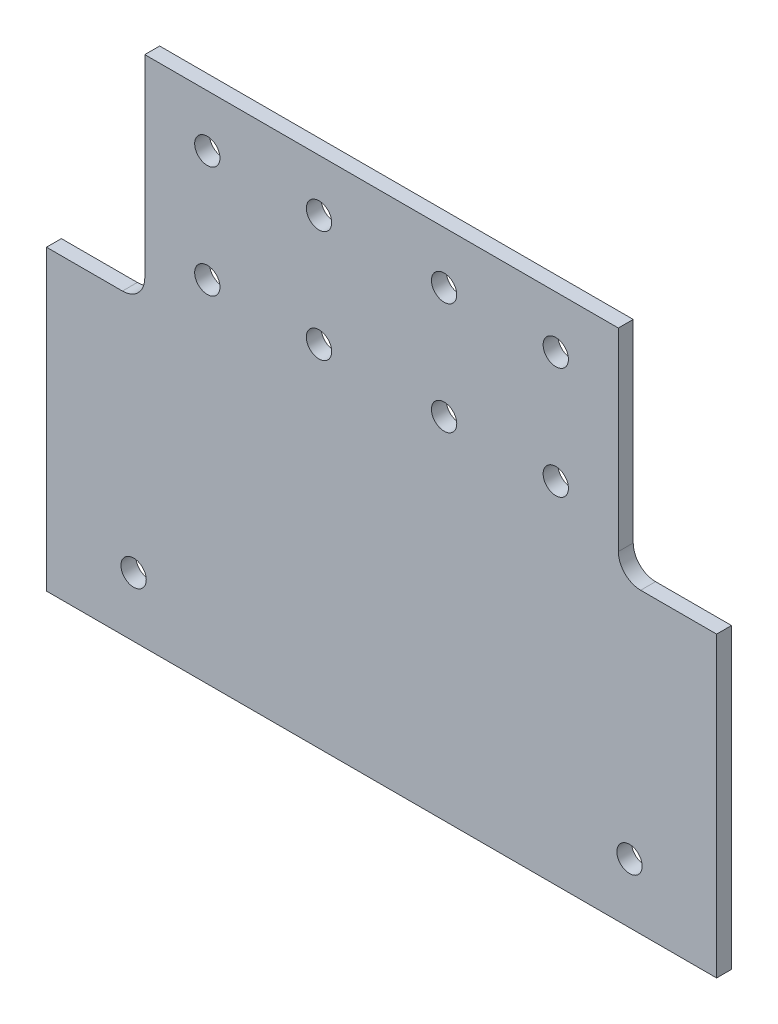
ISO-10303-21;
HEADER;
FILE_DESCRIPTION(('STEP AP214'),'2;1');
FILE_NAME('part.step','',(''),(''),'','','');
FILE_SCHEMA(('AUTOMOTIVE_DESIGN { 1 0 10303 214 1 1 1 1 }'));
ENDSEC;
DATA;
#1=APPLICATION_CONTEXT('core data for automotive mechanical design processes');
#2=APPLICATION_PROTOCOL_DEFINITION('international standard','automotive_design',2000,#1);
#3=PRODUCT_CONTEXT('',#1,'mechanical');
#4=PRODUCT('Part','Part','',(#3));
#5=PRODUCT_RELATED_PRODUCT_CATEGORY('part','',(#4));
#6=PRODUCT_DEFINITION_FORMATION('','',#4);
#7=PRODUCT_DEFINITION_CONTEXT('part definition',#1,'design');
#8=PRODUCT_DEFINITION('design','',#6,#7);
#9=PRODUCT_DEFINITION_SHAPE('','',#8);
#10=(LENGTH_UNIT() NAMED_UNIT(*) SI_UNIT(.MILLI.,.METRE.));
#11=(NAMED_UNIT(*) PLANE_ANGLE_UNIT() SI_UNIT($,.RADIAN.));
#12=(NAMED_UNIT(*) SI_UNIT($,.STERADIAN.) SOLID_ANGLE_UNIT());
#13=UNCERTAINTY_MEASURE_WITH_UNIT(LENGTH_MEASURE(1.E-05),#10,'distance_accuracy_value','');
#14=(GEOMETRIC_REPRESENTATION_CONTEXT(3) GLOBAL_UNCERTAINTY_ASSIGNED_CONTEXT((#13)) GLOBAL_UNIT_ASSIGNED_CONTEXT((#10,
#11,#12)) REPRESENTATION_CONTEXT('',''));
#15=CARTESIAN_POINT('',(0.,0.,0.));
#16=DIRECTION('',(0.,0.,1.));
#17=DIRECTION('',(1.,0.,0.));
#18=AXIS2_PLACEMENT_3D('',#15,#16,#17);
#19=CARTESIAN_POINT('',(-31.7999999999999,-1.02811548082019E-13,2.));
#20=DIRECTION('',(1.,0.,0.));
#21=DIRECTION('',(0.,0.,-1.));
#22=AXIS2_PLACEMENT_3D('',#19,#20,#21);
#23=PLANE('',#22);
#24=DIRECTION('',(0.,-1.,0.));
#25=VECTOR('',#24,1.);
#26=CARTESIAN_POINT('',(-31.7999999999999,-1.02811548082019E-13,0.));
#27=LINE('',#26,#25);
#28=CARTESIAN_POINT('',(-31.7999999999999,-1.02811548082019E-13,0.));
#29=VERTEX_POINT('',#28);
#30=CARTESIAN_POINT('',(-31.7999999999999,-26.0000000000002,0.));
#31=VERTEX_POINT('',#30);
#32=EDGE_CURVE('E149',#29,#31,#27,.T.);
#33=ORIENTED_EDGE('',*,*,#32,.T.);
#34=DIRECTION('',(0.,0.,-1.));
#35=VECTOR('',#34,1.);
#36=CARTESIAN_POINT('',(-31.7999999999999,-26.0000000000002,2.));
#37=LINE('',#36,#35);
#38=CARTESIAN_POINT('',(-31.7999999999999,-26.0000000000002,2.));
#39=VERTEX_POINT('',#38);
#40=EDGE_CURVE('E49',#31,#39,#37,.F.);
#41=ORIENTED_EDGE('',*,*,#40,.T.);
#42=DIRECTION('',(0.,-1.,0.));
#43=VECTOR('',#42,1.);
#44=CARTESIAN_POINT('',(-31.7999999999999,-1.02811548082019E-13,2.));
#45=LINE('',#44,#43);
#46=CARTESIAN_POINT('',(-31.7999999999999,-1.02811548082019E-13,2.));
#47=VERTEX_POINT('',#46);
#48=EDGE_CURVE('E120',#47,#39,#45,.T.);
#49=ORIENTED_EDGE('',*,*,#48,.F.);
#50=DIRECTION('',(0.,0.,-1.));
#51=VECTOR('',#50,1.);
#52=CARTESIAN_POINT('',(-31.7999999999999,-1.02811548082019E-13,2.));
#53=LINE('',#52,#51);
#54=EDGE_CURVE('E148',#47,#29,#53,.T.);
#55=ORIENTED_EDGE('',*,*,#54,.T.);
#56=EDGE_LOOP('',(#33,#41,#49,#55));
#57=FACE_BOUND('',#56,.T.);
#58=ADVANCED_FACE('F34',(#57),#23,.F.);
#59=CARTESIAN_POINT('',(-31.7999999999999,-29.0000000000002,2.));
#60=DIRECTION('',(0.,-1.,0.));
#61=DIRECTION('',(1.,0.,0.));
#62=AXIS2_PLACEMENT_3D('',#59,#60,#61);
#63=PLANE('',#62);
#64=DIRECTION('',(-1.,0.,0.));
#65=VECTOR('',#64,1.);
#66=CARTESIAN_POINT('',(-31.7999999999999,-29.0000000000002,2.));
#67=LINE('',#66,#65);
#68=CARTESIAN_POINT('',(-34.8,-29.0000000000002,2.));
#69=VERTEX_POINT('',#68);
#70=CARTESIAN_POINT('',(-45.,-29.,2.));
#71=VERTEX_POINT('',#70);
#72=EDGE_CURVE('E110',#69,#71,#67,.T.);
#73=ORIENTED_EDGE('',*,*,#72,.F.);
#74=DIRECTION('',(0.,0.,-1.));
#75=VECTOR('',#74,1.);
#76=CARTESIAN_POINT('',(-34.8,-29.0000000000002,0.));
#77=LINE('',#76,#75);
#78=CARTESIAN_POINT('',(-34.8,-29.0000000000002,0.));
#79=VERTEX_POINT('',#78);
#80=EDGE_CURVE('E182',#69,#79,#77,.T.);
#81=ORIENTED_EDGE('',*,*,#80,.T.);
#82=DIRECTION('',(-1.,0.,0.));
#83=VECTOR('',#82,1.);
#84=CARTESIAN_POINT('',(-31.7999999999999,-29.0000000000002,0.));
#85=LINE('',#84,#83);
#86=CARTESIAN_POINT('',(-45.,-29.,0.));
#87=VERTEX_POINT('',#86);
#88=EDGE_CURVE('E125',#79,#87,#85,.T.);
#89=ORIENTED_EDGE('',*,*,#88,.T.);
#90=DIRECTION('',(0.,0.,-1.));
#91=VECTOR('',#90,1.);
#92=CARTESIAN_POINT('',(-45.,-29.,2.));
#93=LINE('',#92,#91);
#94=EDGE_CURVE('E123',#71,#87,#93,.T.);
#95=ORIENTED_EDGE('',*,*,#94,.F.);
#96=EDGE_LOOP('',(#73,#81,#89,#95));
#97=FACE_BOUND('',#96,.T.);
#98=ADVANCED_FACE('F124',(#97),#63,.F.);
#99=CARTESIAN_POINT('',(-45.,-29.,2.));
#100=DIRECTION('',(1.,0.,0.));
#101=DIRECTION('',(0.,1.,0.));
#102=AXIS2_PLACEMENT_3D('',#99,#100,#101);
#103=PLANE('',#102);
#104=DIRECTION('',(0.,-1.,0.));
#105=VECTOR('',#104,1.);
#106=CARTESIAN_POINT('',(-45.,-29.,0.));
#107=LINE('',#106,#105);
#108=CARTESIAN_POINT('',(-45.,-69.,0.));
#109=VERTEX_POINT('',#108);
#110=EDGE_CURVE('E153',#87,#109,#107,.T.);
#111=ORIENTED_EDGE('',*,*,#110,.T.);
#112=DIRECTION('',(0.,0.,-1.));
#113=VECTOR('',#112,1.);
#114=CARTESIAN_POINT('',(-45.,-69.,2.));
#115=LINE('',#114,#113);
#116=CARTESIAN_POINT('',(-45.,-69.,2.));
#117=VERTEX_POINT('',#116);
#118=EDGE_CURVE('E129',#117,#109,#115,.T.);
#119=ORIENTED_EDGE('',*,*,#118,.F.);
#120=DIRECTION('',(0.,-1.,0.));
#121=VECTOR('',#120,1.);
#122=CARTESIAN_POINT('',(-45.,-29.,2.));
#123=LINE('',#122,#121);
#124=EDGE_CURVE('E114',#71,#117,#123,.T.);
#125=ORIENTED_EDGE('',*,*,#124,.F.);
#126=ORIENTED_EDGE('',*,*,#94,.T.);
#127=EDGE_LOOP('',(#111,#119,#125,#126));
#128=FACE_BOUND('',#127,.T.);
#129=ADVANCED_FACE('F131',(#128),#103,.F.);
#130=CARTESIAN_POINT('',(-45.,-69.,2.));
#131=DIRECTION('',(0.,1.,0.));
#132=DIRECTION('',(-1.,0.,0.));
#133=AXIS2_PLACEMENT_3D('',#130,#131,#132);
#134=PLANE('',#133);
#135=DIRECTION('',(1.,0.,0.));
#136=VECTOR('',#135,1.);
#137=CARTESIAN_POINT('',(-45.,-69.,0.));
#138=LINE('',#137,#136);
#139=CARTESIAN_POINT('',(45.,-69.,0.));
#140=VERTEX_POINT('',#139);
#141=EDGE_CURVE('E155',#109,#140,#138,.T.);
#142=ORIENTED_EDGE('',*,*,#141,.T.);
#143=DIRECTION('',(0.,0.,-1.));
#144=VECTOR('',#143,1.);
#145=CARTESIAN_POINT('',(45.,-69.,2.));
#146=LINE('',#145,#144);
#147=CARTESIAN_POINT('',(45.,-69.,2.));
#148=VERTEX_POINT('',#147);
#149=EDGE_CURVE('E174',#148,#140,#146,.T.);
#150=ORIENTED_EDGE('',*,*,#149,.F.);
#151=DIRECTION('',(1.,0.,0.));
#152=VECTOR('',#151,1.);
#153=CARTESIAN_POINT('',(-45.,-69.,2.));
#154=LINE('',#153,#152);
#155=EDGE_CURVE('E134',#117,#148,#154,.T.);
#156=ORIENTED_EDGE('',*,*,#155,.F.);
#157=ORIENTED_EDGE('',*,*,#118,.T.);
#158=EDGE_LOOP('',(#142,#150,#156,#157));
#159=FACE_BOUND('',#158,.T.);
#160=ADVANCED_FACE('F213',(#159),#134,.F.);
#161=CARTESIAN_POINT('',(45.,-29.,2.));
#162=DIRECTION('',(-1.,0.,0.));
#163=DIRECTION('',(0.,-1.,0.));
#164=AXIS2_PLACEMENT_3D('',#161,#162,#163);
#165=PLANE('',#164);
#166=DIRECTION('',(0.,1.,0.));
#167=VECTOR('',#166,1.);
#168=CARTESIAN_POINT('',(45.,-29.,0.));
#169=LINE('',#168,#167);
#170=CARTESIAN_POINT('',(45.,-29.,0.));
#171=VERTEX_POINT('',#170);
#172=EDGE_CURVE('E157',#140,#171,#169,.T.);
#173=ORIENTED_EDGE('',*,*,#172,.T.);
#174=DIRECTION('',(0.,0.,-1.));
#175=VECTOR('',#174,1.);
#176=CARTESIAN_POINT('',(45.,-29.,2.));
#177=LINE('',#176,#175);
#178=CARTESIAN_POINT('',(45.,-29.,2.));
#179=VERTEX_POINT('',#178);
#180=EDGE_CURVE('E171',#179,#171,#177,.T.);
#181=ORIENTED_EDGE('',*,*,#180,.F.);
#182=DIRECTION('',(0.,1.,0.));
#183=VECTOR('',#182,1.);
#184=CARTESIAN_POINT('',(45.,-29.,2.));
#185=LINE('',#184,#183);
#186=EDGE_CURVE('E136',#148,#179,#185,.T.);
#187=ORIENTED_EDGE('',*,*,#186,.F.);
#188=ORIENTED_EDGE('',*,*,#149,.T.);
#189=EDGE_LOOP('',(#173,#181,#187,#188));
#190=FACE_BOUND('',#189,.T.);
#191=ADVANCED_FACE('F209',(#190),#165,.F.);
#192=CARTESIAN_POINT('',(31.8000000000002,-29.0000000000002,2.));
#193=DIRECTION('',(0.,-1.,0.));
#194=DIRECTION('',(1.,0.,0.));
#195=AXIS2_PLACEMENT_3D('',#192,#193,#194);
#196=PLANE('',#195);
#197=DIRECTION('',(-1.,0.,0.));
#198=VECTOR('',#197,1.);
#199=CARTESIAN_POINT('',(31.8000000000002,-29.0000000000002,0.));
#200=LINE('',#199,#198);
#201=CARTESIAN_POINT('',(34.8000000000002,-29.0000000000002,0.));
#202=VERTEX_POINT('',#201);
#203=EDGE_CURVE('E159',#171,#202,#200,.T.);
#204=ORIENTED_EDGE('',*,*,#203,.T.);
#205=DIRECTION('',(0.,0.,-1.));
#206=VECTOR('',#205,1.);
#207=CARTESIAN_POINT('',(34.8000000000002,-29.0000000000002,2.));
#208=LINE('',#207,#206);
#209=CARTESIAN_POINT('',(34.8000000000002,-29.0000000000002,2.));
#210=VERTEX_POINT('',#209);
#211=EDGE_CURVE('E180',#202,#210,#208,.F.);
#212=ORIENTED_EDGE('',*,*,#211,.T.);
#213=DIRECTION('',(-1.,0.,0.));
#214=VECTOR('',#213,1.);
#215=CARTESIAN_POINT('',(31.8000000000002,-29.0000000000002,2.));
#216=LINE('',#215,#214);
#217=EDGE_CURVE('E141',#179,#210,#216,.T.);
#218=ORIENTED_EDGE('',*,*,#217,.F.);
#219=ORIENTED_EDGE('',*,*,#180,.T.);
#220=EDGE_LOOP('',(#204,#212,#218,#219));
#221=FACE_BOUND('',#220,.T.);
#222=ADVANCED_FACE('F205',(#221),#196,.F.);
#223=CARTESIAN_POINT('',(31.8000000000002,0.,2.));
#224=DIRECTION('',(-1.,0.,0.));
#225=DIRECTION('',(0.,0.,1.));
#226=AXIS2_PLACEMENT_3D('',#223,#224,#225);
#227=PLANE('',#226);
#228=DIRECTION('',(0.,1.,0.));
#229=VECTOR('',#228,1.);
#230=CARTESIAN_POINT('',(31.8000000000002,0.,2.));
#231=LINE('',#230,#229);
#232=CARTESIAN_POINT('',(31.8000000000002,-26.0000000000002,2.));
#233=VERTEX_POINT('',#232);
#234=CARTESIAN_POINT('',(31.8000000000002,0.,2.));
#235=VERTEX_POINT('',#234);
#236=EDGE_CURVE('E144',#233,#235,#231,.T.);
#237=ORIENTED_EDGE('',*,*,#236,.F.);
#238=DIRECTION('',(0.,0.,-1.));
#239=VECTOR('',#238,1.);
#240=CARTESIAN_POINT('',(31.8000000000002,-26.0000000000002,0.));
#241=LINE('',#240,#239);
#242=CARTESIAN_POINT('',(31.8000000000002,-26.0000000000002,0.));
#243=VERTEX_POINT('',#242);
#244=EDGE_CURVE('E128',#233,#243,#241,.T.);
#245=ORIENTED_EDGE('',*,*,#244,.T.);
#246=DIRECTION('',(0.,1.,0.));
#247=VECTOR('',#246,1.);
#248=CARTESIAN_POINT('',(31.8000000000002,0.,0.));
#249=LINE('',#248,#247);
#250=CARTESIAN_POINT('',(31.8000000000002,0.,0.));
#251=VERTEX_POINT('',#250);
#252=EDGE_CURVE('E162',#243,#251,#249,.T.);
#253=ORIENTED_EDGE('',*,*,#252,.T.);
#254=DIRECTION('',(0.,0.,-1.));
#255=VECTOR('',#254,1.);
#256=CARTESIAN_POINT('',(31.8000000000002,0.,2.));
#257=LINE('',#256,#255);
#258=EDGE_CURVE('E168',#235,#251,#257,.T.);
#259=ORIENTED_EDGE('',*,*,#258,.F.);
#260=EDGE_LOOP('',(#237,#245,#253,#259));
#261=FACE_BOUND('',#260,.T.);
#262=ADVANCED_FACE('F196',(#261),#227,.F.);
#263=CARTESIAN_POINT('',(31.8000000000002,0.,2.));
#264=DIRECTION('',(0.,-1.,0.));
#265=DIRECTION('',(1.,0.,0.));
#266=AXIS2_PLACEMENT_3D('',#263,#264,#265);
#267=PLANE('',#266);
#268=DIRECTION('',(-1.,0.,0.));
#269=VECTOR('',#268,1.);
#270=CARTESIAN_POINT('',(31.8000000000002,0.,0.));
#271=LINE('',#270,#269);
#272=EDGE_CURVE('E164',#251,#29,#271,.T.);
#273=ORIENTED_EDGE('',*,*,#272,.T.);
#274=ORIENTED_EDGE('',*,*,#54,.F.);
#275=DIRECTION('',(-1.,0.,0.));
#276=VECTOR('',#275,1.);
#277=CARTESIAN_POINT('',(31.8000000000002,0.,2.));
#278=LINE('',#277,#276);
#279=EDGE_CURVE('E146',#235,#47,#278,.T.);
#280=ORIENTED_EDGE('',*,*,#279,.F.);
#281=ORIENTED_EDGE('',*,*,#258,.T.);
#282=EDGE_LOOP('',(#273,#274,#280,#281));
#283=FACE_BOUND('',#282,.T.);
#284=ADVANCED_FACE('F280',(#283),#267,.F.);
#285=CARTESIAN_POINT('',(0.,0.,2.));
#286=DIRECTION('',(0.,0.,-1.));
#287=DIRECTION('',(-1.,0.,0.));
#288=AXIS2_PLACEMENT_3D('',#285,#286,#287);
#289=PLANE('',#288);
#290=CARTESIAN_POINT('',(-23.4,-7.00000000000017,2.));
#291=DIRECTION('',(0.,0.,1.));
#292=DIRECTION('',(1.,0.,0.));
#293=AXIS2_PLACEMENT_3D('',#290,#291,#292);
#294=CIRCLE('',#293,1.7);
#295=CARTESIAN_POINT('',(-21.7,-7.00000000000017,2.));
#296=VERTEX_POINT('',#295);
#297=EDGE_CURVE('E473',#296,#296,#294,.T.);
#298=ORIENTED_EDGE('',*,*,#297,.F.);
#299=EDGE_LOOP('',(#298));
#300=FACE_BOUND('',#299,.T.);
#301=CARTESIAN_POINT('',(-8.4,-7.00000000000017,2.));
#302=DIRECTION('',(0.,0.,1.));
#303=DIRECTION('',(1.,0.,0.));
#304=AXIS2_PLACEMENT_3D('',#301,#302,#303);
#305=CIRCLE('',#304,1.7);
#306=CARTESIAN_POINT('',(-6.7,-7.00000000000017,2.));
#307=VERTEX_POINT('',#306);
#308=EDGE_CURVE('E467',#307,#307,#305,.T.);
#309=ORIENTED_EDGE('',*,*,#308,.F.);
#310=EDGE_LOOP('',(#309));
#311=FACE_BOUND('',#310,.T.);
#312=CARTESIAN_POINT('',(-8.4,-22.0000000000002,2.));
#313=DIRECTION('',(0.,0.,1.));
#314=DIRECTION('',(1.,0.,0.));
#315=AXIS2_PLACEMENT_3D('',#312,#313,#314);
#316=CIRCLE('',#315,1.7);
#317=CARTESIAN_POINT('',(-6.7,-22.0000000000002,2.));
#318=VERTEX_POINT('',#317);
#319=EDGE_CURVE('E461',#318,#318,#316,.T.);
#320=ORIENTED_EDGE('',*,*,#319,.F.);
#321=EDGE_LOOP('',(#320));
#322=FACE_BOUND('',#321,.T.);
#323=CARTESIAN_POINT('',(-23.4,-22.0000000000002,2.));
#324=DIRECTION('',(0.,0.,1.));
#325=DIRECTION('',(1.,0.,0.));
#326=AXIS2_PLACEMENT_3D('',#323,#324,#325);
#327=CIRCLE('',#326,1.7);
#328=CARTESIAN_POINT('',(-21.7,-22.0000000000002,2.));
#329=VERTEX_POINT('',#328);
#330=EDGE_CURVE('E455',#329,#329,#327,.T.);
#331=ORIENTED_EDGE('',*,*,#330,.F.);
#332=EDGE_LOOP('',(#331));
#333=FACE_BOUND('',#332,.T.);
#334=CARTESIAN_POINT('',(-33.3,-61.,2.));
#335=DIRECTION('',(0.,0.,1.));
#336=DIRECTION('',(1.,0.,0.));
#337=AXIS2_PLACEMENT_3D('',#334,#335,#336);
#338=CIRCLE('',#337,1.69999999999999);
#339=CARTESIAN_POINT('',(-31.6,-61.,2.));
#340=VERTEX_POINT('',#339);
#341=EDGE_CURVE('E449',#340,#340,#338,.T.);
#342=ORIENTED_EDGE('',*,*,#341,.F.);
#343=EDGE_LOOP('',(#342));
#344=FACE_BOUND('',#343,.T.);
#345=CARTESIAN_POINT('',(33.3,-61.,2.));
#346=DIRECTION('',(0.,0.,1.));
#347=DIRECTION('',(1.,0.,0.));
#348=AXIS2_PLACEMENT_3D('',#345,#346,#347);
#349=CIRCLE('',#348,1.69999999999999);
#350=CARTESIAN_POINT('',(35.,-61.,2.));
#351=VERTEX_POINT('',#350);
#352=EDGE_CURVE('E443',#351,#351,#349,.T.);
#353=ORIENTED_EDGE('',*,*,#352,.F.);
#354=EDGE_LOOP('',(#353));
#355=FACE_BOUND('',#354,.T.);
#356=CARTESIAN_POINT('',(8.4,-22.0000000000002,2.));
#357=DIRECTION('',(0.,0.,1.));
#358=DIRECTION('',(1.,0.,0.));
#359=AXIS2_PLACEMENT_3D('',#356,#357,#358);
#360=CIRCLE('',#359,1.7);
#361=CARTESIAN_POINT('',(10.1,-22.0000000000002,2.));
#362=VERTEX_POINT('',#361);
#363=EDGE_CURVE('E437',#362,#362,#360,.T.);
#364=ORIENTED_EDGE('',*,*,#363,.F.);
#365=EDGE_LOOP('',(#364));
#366=FACE_BOUND('',#365,.T.);
#367=CARTESIAN_POINT('',(23.4,-22.0000000000002,2.));
#368=DIRECTION('',(0.,0.,1.));
#369=DIRECTION('',(1.,0.,0.));
#370=AXIS2_PLACEMENT_3D('',#367,#368,#369);
#371=CIRCLE('',#370,1.7);
#372=CARTESIAN_POINT('',(25.1,-22.0000000000002,2.));
#373=VERTEX_POINT('',#372);
#374=EDGE_CURVE('E431',#373,#373,#371,.T.);
#375=ORIENTED_EDGE('',*,*,#374,.F.);
#376=EDGE_LOOP('',(#375));
#377=FACE_BOUND('',#376,.T.);
#378=CARTESIAN_POINT('',(8.4,-7.00000000000017,2.));
#379=DIRECTION('',(0.,0.,1.));
#380=DIRECTION('',(1.,0.,0.));
#381=AXIS2_PLACEMENT_3D('',#378,#379,#380);
#382=CIRCLE('',#381,1.7);
#383=CARTESIAN_POINT('',(10.1,-7.00000000000017,2.));
#384=VERTEX_POINT('',#383);
#385=EDGE_CURVE('E425',#384,#384,#382,.T.);
#386=ORIENTED_EDGE('',*,*,#385,.F.);
#387=EDGE_LOOP('',(#386));
#388=FACE_BOUND('',#387,.T.);
#389=CARTESIAN_POINT('',(23.4,-7.00000000000017,2.));
#390=DIRECTION('',(0.,0.,1.));
#391=DIRECTION('',(1.,0.,0.));
#392=AXIS2_PLACEMENT_3D('',#389,#390,#391);
#393=CIRCLE('',#392,1.7);
#394=CARTESIAN_POINT('',(25.1,-7.00000000000017,2.));
#395=VERTEX_POINT('',#394);
#396=EDGE_CURVE('E419',#395,#395,#393,.T.);
#397=ORIENTED_EDGE('',*,*,#396,.F.);
#398=EDGE_LOOP('',(#397));
#399=FACE_BOUND('',#398,.T.);
#400=ORIENTED_EDGE('',*,*,#48,.T.);
#401=CARTESIAN_POINT('',(-34.7999999999999,-26.0000000000002,2.));
#402=DIRECTION('',(0.,0.,-1.));
#403=DIRECTION('',(-1.,0.,0.));
#404=AXIS2_PLACEMENT_3D('',#401,#402,#403);
#405=CIRCLE('',#404,3.);
#406=EDGE_CURVE('E11',#39,#69,#405,.T.);
#407=ORIENTED_EDGE('',*,*,#406,.T.);
#408=ORIENTED_EDGE('',*,*,#72,.T.);
#409=ORIENTED_EDGE('',*,*,#124,.T.);
#410=ORIENTED_EDGE('',*,*,#155,.T.);
#411=ORIENTED_EDGE('',*,*,#186,.T.);
#412=ORIENTED_EDGE('',*,*,#217,.T.);
#413=CARTESIAN_POINT('',(34.8000000000002,-26.0000000000002,2.));
#414=DIRECTION('',(0.,0.,-1.));
#415=DIRECTION('',(-1.,0.,0.));
#416=AXIS2_PLACEMENT_3D('',#413,#414,#415);
#417=CIRCLE('',#416,3.);
#418=EDGE_CURVE('E187',#210,#233,#417,.T.);
#419=ORIENTED_EDGE('',*,*,#418,.T.);
#420=ORIENTED_EDGE('',*,*,#236,.T.);
#421=ORIENTED_EDGE('',*,*,#279,.T.);
#422=EDGE_LOOP('',(#400,#407,#408,#409,#410,#411,#412,#419,#420,#421));
#423=FACE_BOUND('',#422,.T.);
#424=ADVANCED_FACE('F112',(#300,#311,#322,#333,#344,#355,#366,#377,#388,#399,#423),#289,.F.);
#425=CARTESIAN_POINT('',(0.,0.,0.));
#426=DIRECTION('',(0.,0.,-1.));
#427=DIRECTION('',(-1.,0.,0.));
#428=AXIS2_PLACEMENT_3D('',#425,#426,#427);
#429=PLANE('',#428);
#430=CARTESIAN_POINT('',(-23.4,-7.00000000000017,0.));
#431=DIRECTION('',(0.,0.,1.));
#432=DIRECTION('',(1.,0.,0.));
#433=AXIS2_PLACEMENT_3D('',#430,#431,#432);
#434=CIRCLE('',#433,1.7);
#435=CARTESIAN_POINT('',(-21.7,-7.00000000000017,0.));
#436=VERTEX_POINT('',#435);
#437=EDGE_CURVE('E470',#436,#436,#434,.T.);
#438=ORIENTED_EDGE('',*,*,#437,.T.);
#439=EDGE_LOOP('',(#438));
#440=FACE_BOUND('',#439,.T.);
#441=CARTESIAN_POINT('',(-8.4,-7.00000000000017,0.));
#442=DIRECTION('',(0.,0.,1.));
#443=DIRECTION('',(1.,0.,0.));
#444=AXIS2_PLACEMENT_3D('',#441,#442,#443);
#445=CIRCLE('',#444,1.7);
#446=CARTESIAN_POINT('',(-6.7,-7.00000000000017,0.));
#447=VERTEX_POINT('',#446);
#448=EDGE_CURVE('E464',#447,#447,#445,.T.);
#449=ORIENTED_EDGE('',*,*,#448,.T.);
#450=EDGE_LOOP('',(#449));
#451=FACE_BOUND('',#450,.T.);
#452=CARTESIAN_POINT('',(-8.4,-22.0000000000002,0.));
#453=DIRECTION('',(0.,0.,1.));
#454=DIRECTION('',(1.,0.,0.));
#455=AXIS2_PLACEMENT_3D('',#452,#453,#454);
#456=CIRCLE('',#455,1.7);
#457=CARTESIAN_POINT('',(-6.7,-22.0000000000002,0.));
#458=VERTEX_POINT('',#457);
#459=EDGE_CURVE('E458',#458,#458,#456,.T.);
#460=ORIENTED_EDGE('',*,*,#459,.T.);
#461=EDGE_LOOP('',(#460));
#462=FACE_BOUND('',#461,.T.);
#463=CARTESIAN_POINT('',(-23.4,-22.0000000000002,0.));
#464=DIRECTION('',(0.,0.,1.));
#465=DIRECTION('',(1.,0.,0.));
#466=AXIS2_PLACEMENT_3D('',#463,#464,#465);
#467=CIRCLE('',#466,1.7);
#468=CARTESIAN_POINT('',(-21.7,-22.0000000000002,0.));
#469=VERTEX_POINT('',#468);
#470=EDGE_CURVE('E452',#469,#469,#467,.T.);
#471=ORIENTED_EDGE('',*,*,#470,.T.);
#472=EDGE_LOOP('',(#471));
#473=FACE_BOUND('',#472,.T.);
#474=CARTESIAN_POINT('',(-33.3,-61.,0.));
#475=DIRECTION('',(0.,0.,1.));
#476=DIRECTION('',(1.,0.,0.));
#477=AXIS2_PLACEMENT_3D('',#474,#475,#476);
#478=CIRCLE('',#477,1.7);
#479=CARTESIAN_POINT('',(-31.6,-61.,0.));
#480=VERTEX_POINT('',#479);
#481=EDGE_CURVE('E446',#480,#480,#478,.T.);
#482=ORIENTED_EDGE('',*,*,#481,.T.);
#483=EDGE_LOOP('',(#482));
#484=FACE_BOUND('',#483,.T.);
#485=CARTESIAN_POINT('',(33.3,-61.,0.));
#486=DIRECTION('',(0.,0.,1.));
#487=DIRECTION('',(1.,0.,0.));
#488=AXIS2_PLACEMENT_3D('',#485,#486,#487);
#489=CIRCLE('',#488,1.7);
#490=CARTESIAN_POINT('',(35.,-61.,0.));
#491=VERTEX_POINT('',#490);
#492=EDGE_CURVE('E440',#491,#491,#489,.T.);
#493=ORIENTED_EDGE('',*,*,#492,.T.);
#494=EDGE_LOOP('',(#493));
#495=FACE_BOUND('',#494,.T.);
#496=CARTESIAN_POINT('',(8.4,-22.0000000000002,0.));
#497=DIRECTION('',(0.,0.,1.));
#498=DIRECTION('',(1.,0.,0.));
#499=AXIS2_PLACEMENT_3D('',#496,#497,#498);
#500=CIRCLE('',#499,1.7);
#501=CARTESIAN_POINT('',(10.1,-22.0000000000002,0.));
#502=VERTEX_POINT('',#501);
#503=EDGE_CURVE('E434',#502,#502,#500,.T.);
#504=ORIENTED_EDGE('',*,*,#503,.T.);
#505=EDGE_LOOP('',(#504));
#506=FACE_BOUND('',#505,.T.);
#507=CARTESIAN_POINT('',(23.4,-22.0000000000002,0.));
#508=DIRECTION('',(0.,0.,1.));
#509=DIRECTION('',(1.,0.,0.));
#510=AXIS2_PLACEMENT_3D('',#507,#508,#509);
#511=CIRCLE('',#510,1.7);
#512=CARTESIAN_POINT('',(25.1,-22.0000000000002,0.));
#513=VERTEX_POINT('',#512);
#514=EDGE_CURVE('E428',#513,#513,#511,.T.);
#515=ORIENTED_EDGE('',*,*,#514,.T.);
#516=EDGE_LOOP('',(#515));
#517=FACE_BOUND('',#516,.T.);
#518=CARTESIAN_POINT('',(8.4,-7.00000000000017,0.));
#519=DIRECTION('',(0.,0.,1.));
#520=DIRECTION('',(1.,0.,0.));
#521=AXIS2_PLACEMENT_3D('',#518,#519,#520);
#522=CIRCLE('',#521,1.7);
#523=CARTESIAN_POINT('',(10.1,-7.00000000000017,0.));
#524=VERTEX_POINT('',#523);
#525=EDGE_CURVE('E422',#524,#524,#522,.T.);
#526=ORIENTED_EDGE('',*,*,#525,.T.);
#527=EDGE_LOOP('',(#526));
#528=FACE_BOUND('',#527,.T.);
#529=CARTESIAN_POINT('',(23.4,-7.00000000000017,0.));
#530=DIRECTION('',(0.,0.,1.));
#531=DIRECTION('',(1.,0.,0.));
#532=AXIS2_PLACEMENT_3D('',#529,#530,#531);
#533=CIRCLE('',#532,1.7);
#534=CARTESIAN_POINT('',(25.1,-7.00000000000017,0.));
#535=VERTEX_POINT('',#534);
#536=EDGE_CURVE('E151',#535,#535,#533,.T.);
#537=ORIENTED_EDGE('',*,*,#536,.T.);
#538=EDGE_LOOP('',(#537));
#539=FACE_BOUND('',#538,.T.);
#540=ORIENTED_EDGE('',*,*,#32,.F.);
#541=ORIENTED_EDGE('',*,*,#272,.F.);
#542=ORIENTED_EDGE('',*,*,#252,.F.);
#543=CARTESIAN_POINT('',(34.8000000000002,-26.0000000000002,0.));
#544=DIRECTION('',(0.,0.,-1.));
#545=DIRECTION('',(-1.,0.,0.));
#546=AXIS2_PLACEMENT_3D('',#543,#544,#545);
#547=CIRCLE('',#546,3.);
#548=EDGE_CURVE('E185',#243,#202,#547,.F.);
#549=ORIENTED_EDGE('',*,*,#548,.T.);
#550=ORIENTED_EDGE('',*,*,#203,.F.);
#551=ORIENTED_EDGE('',*,*,#172,.F.);
#552=ORIENTED_EDGE('',*,*,#141,.F.);
#553=ORIENTED_EDGE('',*,*,#110,.F.);
#554=ORIENTED_EDGE('',*,*,#88,.F.);
#555=CARTESIAN_POINT('',(-34.7999999999999,-26.0000000000002,0.));
#556=DIRECTION('',(0.,0.,-1.));
#557=DIRECTION('',(-1.,0.,0.));
#558=AXIS2_PLACEMENT_3D('',#555,#556,#557);
#559=CIRCLE('',#558,3.);
#560=EDGE_CURVE('E42',#79,#31,#559,.F.);
#561=ORIENTED_EDGE('',*,*,#560,.T.);
#562=EDGE_LOOP('',(#540,#541,#542,#549,#550,#551,#552,#553,#554,#561));
#563=FACE_BOUND('',#562,.T.);
#564=ADVANCED_FACE('F201',(#440,#451,#462,#473,#484,#495,#506,#517,#528,#539,#563),#429,.T.);
#565=CARTESIAN_POINT('',(23.4,-7.00000000000017,2.));
#566=DIRECTION('',(0.,0.,1.));
#567=DIRECTION('',(1.,0.,0.));
#568=AXIS2_PLACEMENT_3D('',#565,#566,#567);
#569=CYLINDRICAL_SURFACE('',#568,1.7);
#570=ORIENTED_EDGE('',*,*,#536,.F.);
#571=EDGE_LOOP('',(#570));
#572=FACE_BOUND('',#571,.T.);
#573=ORIENTED_EDGE('',*,*,#396,.T.);
#574=EDGE_LOOP('',(#573));
#575=FACE_BOUND('',#574,.T.);
#576=ADVANCED_FACE('F273',(#572,#575),#569,.F.);
#577=CARTESIAN_POINT('',(8.4,-7.00000000000017,2.));
#578=DIRECTION('',(0.,0.,1.));
#579=DIRECTION('',(1.,0.,0.));
#580=AXIS2_PLACEMENT_3D('',#577,#578,#579);
#581=CYLINDRICAL_SURFACE('',#580,1.7);
#582=ORIENTED_EDGE('',*,*,#525,.F.);
#583=EDGE_LOOP('',(#582));
#584=FACE_BOUND('',#583,.T.);
#585=ORIENTED_EDGE('',*,*,#385,.T.);
#586=EDGE_LOOP('',(#585));
#587=FACE_BOUND('',#586,.T.);
#588=ADVANCED_FACE('F269',(#584,#587),#581,.F.);
#589=CARTESIAN_POINT('',(23.4,-22.0000000000002,2.));
#590=DIRECTION('',(0.,0.,1.));
#591=DIRECTION('',(1.,0.,0.));
#592=AXIS2_PLACEMENT_3D('',#589,#590,#591);
#593=CYLINDRICAL_SURFACE('',#592,1.7);
#594=ORIENTED_EDGE('',*,*,#514,.F.);
#595=EDGE_LOOP('',(#594));
#596=FACE_BOUND('',#595,.T.);
#597=ORIENTED_EDGE('',*,*,#374,.T.);
#598=EDGE_LOOP('',(#597));
#599=FACE_BOUND('',#598,.T.);
#600=ADVANCED_FACE('F265',(#596,#599),#593,.F.);
#601=CARTESIAN_POINT('',(8.4,-22.0000000000002,2.));
#602=DIRECTION('',(0.,0.,1.));
#603=DIRECTION('',(1.,0.,0.));
#604=AXIS2_PLACEMENT_3D('',#601,#602,#603);
#605=CYLINDRICAL_SURFACE('',#604,1.7);
#606=ORIENTED_EDGE('',*,*,#503,.F.);
#607=EDGE_LOOP('',(#606));
#608=FACE_BOUND('',#607,.T.);
#609=ORIENTED_EDGE('',*,*,#363,.T.);
#610=EDGE_LOOP('',(#609));
#611=FACE_BOUND('',#610,.T.);
#612=ADVANCED_FACE('F261',(#608,#611),#605,.F.);
#613=CARTESIAN_POINT('',(33.3,-61.,2.));
#614=DIRECTION('',(0.,0.,1.));
#615=DIRECTION('',(1.,0.,0.));
#616=AXIS2_PLACEMENT_3D('',#613,#614,#615);
#617=CYLINDRICAL_SURFACE('',#616,1.7);
#618=ORIENTED_EDGE('',*,*,#492,.F.);
#619=EDGE_LOOP('',(#618));
#620=FACE_BOUND('',#619,.T.);
#621=ORIENTED_EDGE('',*,*,#352,.T.);
#622=EDGE_LOOP('',(#621));
#623=FACE_BOUND('',#622,.T.);
#624=ADVANCED_FACE('F257',(#620,#623),#617,.F.);
#625=CARTESIAN_POINT('',(-33.3,-61.,2.));
#626=DIRECTION('',(0.,0.,1.));
#627=DIRECTION('',(1.,0.,0.));
#628=AXIS2_PLACEMENT_3D('',#625,#626,#627);
#629=CYLINDRICAL_SURFACE('',#628,1.7);
#630=ORIENTED_EDGE('',*,*,#481,.F.);
#631=EDGE_LOOP('',(#630));
#632=FACE_BOUND('',#631,.T.);
#633=ORIENTED_EDGE('',*,*,#341,.T.);
#634=EDGE_LOOP('',(#633));
#635=FACE_BOUND('',#634,.T.);
#636=ADVANCED_FACE('F253',(#632,#635),#629,.F.);
#637=CARTESIAN_POINT('',(-23.4,-22.0000000000002,2.));
#638=DIRECTION('',(0.,0.,1.));
#639=DIRECTION('',(1.,0.,0.));
#640=AXIS2_PLACEMENT_3D('',#637,#638,#639);
#641=CYLINDRICAL_SURFACE('',#640,1.7);
#642=ORIENTED_EDGE('',*,*,#470,.F.);
#643=EDGE_LOOP('',(#642));
#644=FACE_BOUND('',#643,.T.);
#645=ORIENTED_EDGE('',*,*,#330,.T.);
#646=EDGE_LOOP('',(#645));
#647=FACE_BOUND('',#646,.T.);
#648=ADVANCED_FACE('F249',(#644,#647),#641,.F.);
#649=CARTESIAN_POINT('',(-8.4,-22.0000000000002,2.));
#650=DIRECTION('',(0.,0.,1.));
#651=DIRECTION('',(1.,0.,0.));
#652=AXIS2_PLACEMENT_3D('',#649,#650,#651);
#653=CYLINDRICAL_SURFACE('',#652,1.7);
#654=ORIENTED_EDGE('',*,*,#459,.F.);
#655=EDGE_LOOP('',(#654));
#656=FACE_BOUND('',#655,.T.);
#657=ORIENTED_EDGE('',*,*,#319,.T.);
#658=EDGE_LOOP('',(#657));
#659=FACE_BOUND('',#658,.T.);
#660=ADVANCED_FACE('F241',(#656,#659),#653,.F.);
#661=CARTESIAN_POINT('',(-8.4,-7.00000000000017,2.));
#662=DIRECTION('',(0.,0.,1.));
#663=DIRECTION('',(1.,0.,0.));
#664=AXIS2_PLACEMENT_3D('',#661,#662,#663);
#665=CYLINDRICAL_SURFACE('',#664,1.7);
#666=ORIENTED_EDGE('',*,*,#448,.F.);
#667=EDGE_LOOP('',(#666));
#668=FACE_BOUND('',#667,.T.);
#669=ORIENTED_EDGE('',*,*,#308,.T.);
#670=EDGE_LOOP('',(#669));
#671=FACE_BOUND('',#670,.T.);
#672=ADVANCED_FACE('F235',(#668,#671),#665,.F.);
#673=CARTESIAN_POINT('',(-23.4,-7.00000000000017,2.));
#674=DIRECTION('',(0.,0.,1.));
#675=DIRECTION('',(1.,0.,0.));
#676=AXIS2_PLACEMENT_3D('',#673,#674,#675);
#677=CYLINDRICAL_SURFACE('',#676,1.7);
#678=ORIENTED_EDGE('',*,*,#437,.F.);
#679=EDGE_LOOP('',(#678));
#680=FACE_BOUND('',#679,.T.);
#681=ORIENTED_EDGE('',*,*,#297,.T.);
#682=EDGE_LOOP('',(#681));
#683=FACE_BOUND('',#682,.T.);
#684=ADVANCED_FACE('F229',(#680,#683),#677,.F.);
#685=CARTESIAN_POINT('',(34.8000000000002,-26.0000000000002,2.));
#686=DIRECTION('',(0.,0.,1.));
#687=DIRECTION('',(1.,0.,0.));
#688=AXIS2_PLACEMENT_3D('',#685,#686,#687);
#689=CYLINDRICAL_SURFACE('',#688,3.);
#690=ORIENTED_EDGE('',*,*,#418,.F.);
#691=ORIENTED_EDGE('',*,*,#211,.F.);
#692=ORIENTED_EDGE('',*,*,#548,.F.);
#693=ORIENTED_EDGE('',*,*,#244,.F.);
#694=EDGE_LOOP('',(#690,#691,#692,#693));
#695=FACE_BOUND('',#694,.T.);
#696=ADVANCED_FACE('F199',(#695),#689,.F.);
#697=CARTESIAN_POINT('',(-34.7999999999999,-26.0000000000002,2.));
#698=DIRECTION('',(0.,0.,1.));
#699=DIRECTION('',(1.,0.,0.));
#700=AXIS2_PLACEMENT_3D('',#697,#698,#699);
#701=CYLINDRICAL_SURFACE('',#700,3.);
#702=ORIENTED_EDGE('',*,*,#406,.F.);
#703=ORIENTED_EDGE('',*,*,#40,.F.);
#704=ORIENTED_EDGE('',*,*,#560,.F.);
#705=ORIENTED_EDGE('',*,*,#80,.F.);
#706=EDGE_LOOP('',(#702,#703,#704,#705));
#707=FACE_BOUND('',#706,.T.);
#708=ADVANCED_FACE('F36',(#707),#701,.F.);
#709=CLOSED_SHELL('',(#58,#98,#129,#160,#191,#222,#262,#284,#424,#564,#576,#588,#600,#612,#624,
#636,#648,#660,#672,#684,#696,#708));
#710=MANIFOLD_SOLID_BREP('B2',#709);
#711=ADVANCED_BREP_SHAPE_REPRESENTATION('',(#18,#710),#14);
#712=SHAPE_DEFINITION_REPRESENTATION(#9,#711);
ENDSEC;
END-ISO-10303-21;
